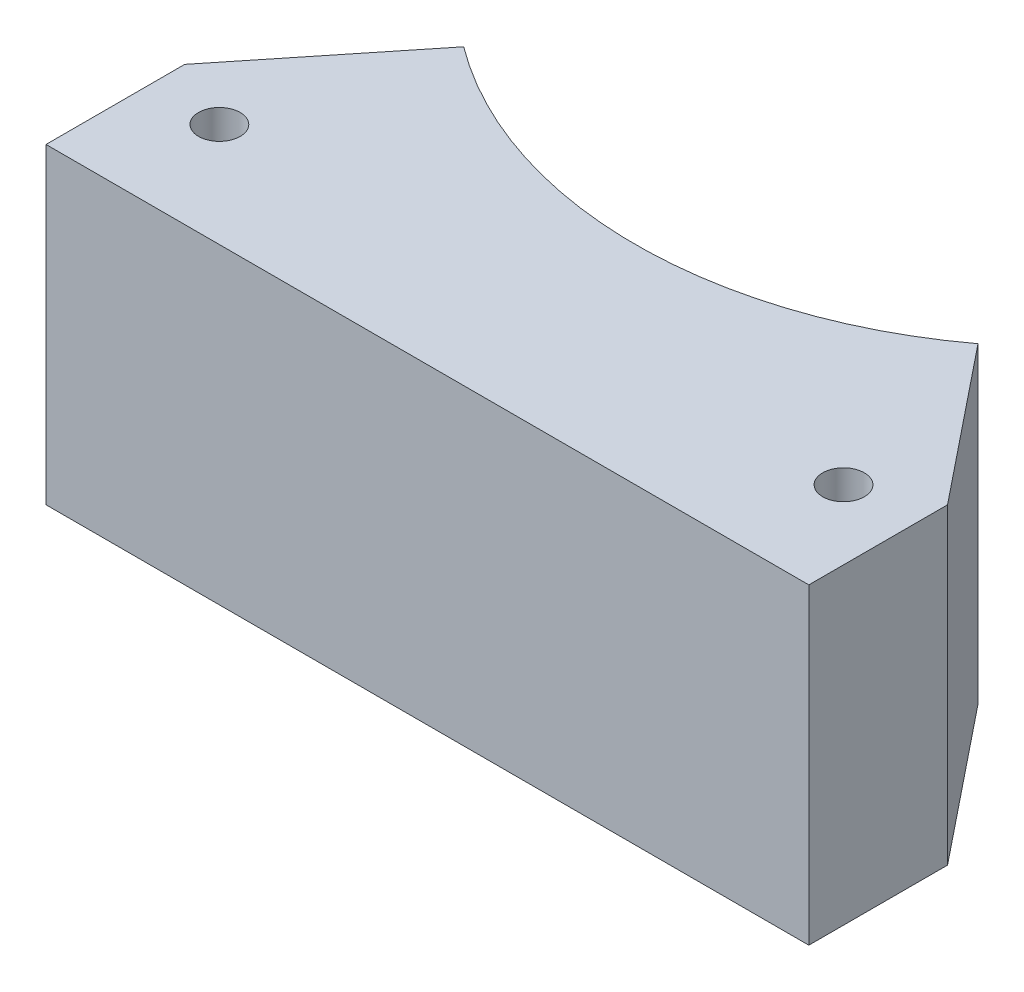
ISO-10303-21;
HEADER;
FILE_DESCRIPTION(('STEP AP214'),'2;1');
FILE_NAME('part.step','',(''),(''),'','','');
FILE_SCHEMA(('AUTOMOTIVE_DESIGN { 1 0 10303 214 1 1 1 1 }'));
ENDSEC;
DATA;
#1=APPLICATION_CONTEXT('core data for automotive mechanical design processes');
#2=APPLICATION_PROTOCOL_DEFINITION('international standard','automotive_design',2000,#1);
#3=PRODUCT_CONTEXT('',#1,'mechanical');
#4=PRODUCT('Part','Part','',(#3));
#5=PRODUCT_RELATED_PRODUCT_CATEGORY('part','',(#4));
#6=PRODUCT_DEFINITION_FORMATION('','',#4);
#7=PRODUCT_DEFINITION_CONTEXT('part definition',#1,'design');
#8=PRODUCT_DEFINITION('design','',#6,#7);
#9=PRODUCT_DEFINITION_SHAPE('','',#8);
#10=(LENGTH_UNIT() NAMED_UNIT(*) SI_UNIT(.MILLI.,.METRE.));
#11=(NAMED_UNIT(*) PLANE_ANGLE_UNIT() SI_UNIT($,.RADIAN.));
#12=(NAMED_UNIT(*) SI_UNIT($,.STERADIAN.) SOLID_ANGLE_UNIT());
#13=UNCERTAINTY_MEASURE_WITH_UNIT(LENGTH_MEASURE(1.E-05),#10,'distance_accuracy_value','');
#14=(GEOMETRIC_REPRESENTATION_CONTEXT(3) GLOBAL_UNCERTAINTY_ASSIGNED_CONTEXT((#13)) GLOBAL_UNIT_ASSIGNED_CONTEXT((#10,
#11,#12)) REPRESENTATION_CONTEXT('',''));
#15=CARTESIAN_POINT('',(0.,0.,0.));
#16=DIRECTION('',(0.,0.,1.));
#17=DIRECTION('',(1.,0.,0.));
#18=AXIS2_PLACEMENT_3D('',#15,#16,#17);
#19=CARTESIAN_POINT('',(-33.1340055886578,45.,2.16335205768863));
#20=DIRECTION('',(1.,0.,0.));
#21=DIRECTION('',(0.,0.,-1.));
#22=AXIS2_PLACEMENT_3D('',#19,#20,#21);
#23=PLANE('',#22);
#24=DIRECTION('',(0.,0.,1.));
#25=VECTOR('',#24,1.);
#26=CARTESIAN_POINT('',(-33.1340055886578,0.,2.16335205768863));
#27=LINE('',#26,#25);
#28=CARTESIAN_POINT('',(-33.1340055886578,0.,2.16335205768863));
#29=VERTEX_POINT('',#28);
#30=CARTESIAN_POINT('',(-33.1340055886578,0.,22.1633520576886));
#31=VERTEX_POINT('',#30);
#32=EDGE_CURVE('E99',#29,#31,#27,.T.);
#33=ORIENTED_EDGE('',*,*,#32,.T.);
#34=DIRECTION('',(0.,-1.,0.));
#35=VECTOR('',#34,1.);
#36=CARTESIAN_POINT('',(-33.1340055886578,45.,22.1633520576886));
#37=LINE('',#36,#35);
#38=CARTESIAN_POINT('',(-33.1340055886578,45.,22.1633520576886));
#39=VERTEX_POINT('',#38);
#40=EDGE_CURVE('E40',#39,#31,#37,.T.);
#41=ORIENTED_EDGE('',*,*,#40,.F.);
#42=DIRECTION('',(0.,0.,1.));
#43=VECTOR('',#42,1.);
#44=CARTESIAN_POINT('',(-33.1340055886578,45.,2.16335205768863));
#45=LINE('',#44,#43);
#46=CARTESIAN_POINT('',(-33.1340055886578,45.,2.16335205768863));
#47=VERTEX_POINT('',#46);
#48=EDGE_CURVE('E97',#47,#39,#45,.T.);
#49=ORIENTED_EDGE('',*,*,#48,.F.);
#50=DIRECTION('',(0.,-1.,0.));
#51=VECTOR('',#50,1.);
#52=CARTESIAN_POINT('',(-33.1340055886578,45.,2.16335205768863));
#53=LINE('',#52,#51);
#54=EDGE_CURVE('E86',#47,#29,#53,.T.);
#55=ORIENTED_EDGE('',*,*,#54,.T.);
#56=EDGE_LOOP('',(#33,#41,#49,#55));
#57=FACE_BOUND('',#56,.T.);
#58=ADVANCED_FACE('F33',(#57),#23,.F.);
#59=CARTESIAN_POINT('',(-33.1340055886578,45.,22.1633520576886));
#60=DIRECTION('',(0.,0.,-1.));
#61=DIRECTION('',(-1.,0.,0.));
#62=AXIS2_PLACEMENT_3D('',#59,#60,#61);
#63=PLANE('',#62);
#64=DIRECTION('',(1.,0.,0.));
#65=VECTOR('',#64,1.);
#66=CARTESIAN_POINT('',(-33.1340055886578,0.,22.1633520576886));
#67=LINE('',#66,#65);
#68=CARTESIAN_POINT('',(76.8659944113422,0.,22.1633520576886));
#69=VERTEX_POINT('',#68);
#70=EDGE_CURVE('E95',#31,#69,#67,.T.);
#71=ORIENTED_EDGE('',*,*,#70,.T.);
#72=DIRECTION('',(0.,-1.,0.));
#73=VECTOR('',#72,1.);
#74=CARTESIAN_POINT('',(76.8659944113422,45.,22.1633520576886));
#75=LINE('',#74,#73);
#76=CARTESIAN_POINT('',(76.8659944113422,45.,22.1633520576886));
#77=VERTEX_POINT('',#76);
#78=EDGE_CURVE('E85',#77,#69,#75,.T.);
#79=ORIENTED_EDGE('',*,*,#78,.F.);
#80=DIRECTION('',(1.,0.,0.));
#81=VECTOR('',#80,1.);
#82=CARTESIAN_POINT('',(-33.1340055886578,45.,22.1633520576886));
#83=LINE('',#82,#81);
#84=EDGE_CURVE('E56',#39,#77,#83,.T.);
#85=ORIENTED_EDGE('',*,*,#84,.F.);
#86=ORIENTED_EDGE('',*,*,#40,.T.);
#87=EDGE_LOOP('',(#71,#79,#85,#86));
#88=FACE_BOUND('',#87,.T.);
#89=ADVANCED_FACE('F110',(#88),#63,.F.);
#90=CARTESIAN_POINT('',(76.8659944113422,45.,22.1633520576886));
#91=DIRECTION('',(-1.,0.,0.));
#92=DIRECTION('',(0.,0.,1.));
#93=AXIS2_PLACEMENT_3D('',#90,#91,#92);
#94=PLANE('',#93);
#95=DIRECTION('',(0.,0.,-1.));
#96=VECTOR('',#95,1.);
#97=CARTESIAN_POINT('',(76.8659944113422,0.,22.1633520576886));
#98=LINE('',#97,#96);
#99=CARTESIAN_POINT('',(76.8659944113422,0.,2.16335205768863));
#100=VERTEX_POINT('',#99);
#101=EDGE_CURVE('E91',#69,#100,#98,.T.);
#102=ORIENTED_EDGE('',*,*,#101,.T.);
#103=DIRECTION('',(0.,-1.,0.));
#104=VECTOR('',#103,1.);
#105=CARTESIAN_POINT('',(76.8659944113422,45.,2.16335205768863));
#106=LINE('',#105,#104);
#107=CARTESIAN_POINT('',(76.8659944113422,45.,2.16335205768863));
#108=VERTEX_POINT('',#107);
#109=EDGE_CURVE('E73',#108,#100,#106,.T.);
#110=ORIENTED_EDGE('',*,*,#109,.F.);
#111=DIRECTION('',(0.,0.,-1.));
#112=VECTOR('',#111,1.);
#113=CARTESIAN_POINT('',(76.8659944113422,45.,22.1633520576886));
#114=LINE('',#113,#112);
#115=EDGE_CURVE('E123',#77,#108,#114,.T.);
#116=ORIENTED_EDGE('',*,*,#115,.F.);
#117=ORIENTED_EDGE('',*,*,#78,.T.);
#118=EDGE_LOOP('',(#102,#110,#116,#117));
#119=FACE_BOUND('',#118,.T.);
#120=ADVANCED_FACE('F94',(#119),#94,.F.);
#121=CARTESIAN_POINT('',(21.8659944113422,45.,-69.8366479423114));
#122=DIRECTION('',(0.,-1.,0.));
#123=DIRECTION('',(0.,0.,-1.));
#124=AXIS2_PLACEMENT_3D('',#121,#122,#123);
#125=CYLINDRICAL_SURFACE('',#124,62.);
#126=CARTESIAN_POINT('',(21.8659944113422,45.,-69.8366479423114));
#127=DIRECTION('',(0.,-1.,0.));
#128=DIRECTION('',(0.,0.,1.));
#129=AXIS2_PLACEMENT_3D('',#126,#127,#128);
#130=CIRCLE('',#129,62.);
#131=CARTESIAN_POINT('',(58.9475164017854,45.,-20.1480101377561));
#132=VERTEX_POINT('',#131);
#133=CARTESIAN_POINT('',(-15.2155275791011,45.,-20.1480101377561));
#134=VERTEX_POINT('',#133);
#135=EDGE_CURVE('E104',#132,#134,#130,.T.);
#136=ORIENTED_EDGE('',*,*,#135,.F.);
#137=DIRECTION('',(0.,-1.,0.));
#138=VECTOR('',#137,1.);
#139=CARTESIAN_POINT('',(58.9475164017854,45.,-20.1480101377561));
#140=LINE('',#139,#138);
#141=CARTESIAN_POINT('',(58.9475164017854,0.,-20.1480101377561));
#142=VERTEX_POINT('',#141);
#143=EDGE_CURVE('E140',#132,#142,#140,.T.);
#144=ORIENTED_EDGE('',*,*,#143,.T.);
#145=CARTESIAN_POINT('',(21.8659944113422,0.,-69.8366479423114));
#146=DIRECTION('',(0.,-1.,0.));
#147=DIRECTION('',(0.,0.,1.));
#148=AXIS2_PLACEMENT_3D('',#145,#146,#147);
#149=CIRCLE('',#148,62.);
#150=CARTESIAN_POINT('',(-15.2155275791011,0.,-20.1480101377561));
#151=VERTEX_POINT('',#150);
#152=EDGE_CURVE('E47',#142,#151,#149,.T.);
#153=ORIENTED_EDGE('',*,*,#152,.T.);
#154=DIRECTION('',(0.,-1.,0.));
#155=VECTOR('',#154,1.);
#156=CARTESIAN_POINT('',(-15.2155275791011,45.,-20.1480101377561));
#157=LINE('',#156,#155);
#158=EDGE_CURVE('E133',#151,#134,#157,.F.);
#159=ORIENTED_EDGE('',*,*,#158,.T.);
#160=EDGE_LOOP('',(#136,#144,#153,#159));
#161=FACE_BOUND('',#160,.T.);
#162=ADVANCED_FACE('F148',(#161),#125,.F.);
#163=CARTESIAN_POINT('',(21.8659944113422,45.,-69.8366479423114));
#164=DIRECTION('',(0.,1.,0.));
#165=DIRECTION('',(0.,0.,1.));
#166=AXIS2_PLACEMENT_3D('',#163,#164,#165);
#167=PLANE('',#166);
#168=DIRECTION('',(-0.626172474133936,0.,-0.77968457252724));
#169=VECTOR('',#168,1.);
#170=CARTESIAN_POINT('',(55.8145044286086,45.,-24.0491095982645));
#171=LINE('',#170,#169);
#172=EDGE_CURVE('E81',#108,#132,#171,.T.);
#173=ORIENTED_EDGE('',*,*,#172,.T.);
#174=ORIENTED_EDGE('',*,*,#135,.T.);
#175=DIRECTION('',(-0.626172474133936,0.,0.77968457252724));
#176=VECTOR('',#175,1.);
#177=CARTESIAN_POINT('',(-12.0825156059243,45.,-24.0491095982645));
#178=LINE('',#177,#176);
#179=EDGE_CURVE('E137',#134,#47,#178,.T.);
#180=ORIENTED_EDGE('',*,*,#179,.T.);
#181=ORIENTED_EDGE('',*,*,#48,.T.);
#182=ORIENTED_EDGE('',*,*,#84,.T.);
#183=ORIENTED_EDGE('',*,*,#115,.T.);
#184=EDGE_LOOP('',(#173,#174,#180,#181,#182,#183));
#185=FACE_BOUND('',#184,.T.);
#186=CARTESIAN_POINT('',(66.8659944113422,45.,7.16335205768863));
#187=DIRECTION('',(0.,1.,0.));
#188=DIRECTION('',(0.,0.,1.));
#189=AXIS2_PLACEMENT_3D('',#186,#187,#188);
#190=CIRCLE('',#189,3.00000000000004);
#191=CARTESIAN_POINT('',(66.8659944113422,45.,10.1633520576887));
#192=VERTEX_POINT('',#191);
#193=EDGE_CURVE('E130',#192,#192,#190,.T.);
#194=ORIENTED_EDGE('',*,*,#193,.F.);
#195=EDGE_LOOP('',(#194));
#196=FACE_BOUND('',#195,.T.);
#197=CARTESIAN_POINT('',(-23.1340055886578,45.,7.16335205768863));
#198=DIRECTION('',(0.,1.,0.));
#199=DIRECTION('',(0.,0.,1.));
#200=AXIS2_PLACEMENT_3D('',#197,#198,#199);
#201=CIRCLE('',#200,3.);
#202=CARTESIAN_POINT('',(-23.1340055886578,45.,10.1633520576886));
#203=VERTEX_POINT('',#202);
#204=EDGE_CURVE('E118',#203,#203,#201,.T.);
#205=ORIENTED_EDGE('',*,*,#204,.F.);
#206=EDGE_LOOP('',(#205));
#207=FACE_BOUND('',#206,.T.);
#208=ADVANCED_FACE('F144',(#185,#196,#207),#167,.T.);
#209=CARTESIAN_POINT('',(21.8659944113422,0.,-69.8366479423114));
#210=DIRECTION('',(0.,1.,0.));
#211=DIRECTION('',(0.,0.,1.));
#212=AXIS2_PLACEMENT_3D('',#209,#210,#211);
#213=PLANE('',#212);
#214=CARTESIAN_POINT('',(66.8659944113422,0.,7.16335205768863));
#215=DIRECTION('',(0.,1.,0.));
#216=DIRECTION('',(0.,0.,1.));
#217=AXIS2_PLACEMENT_3D('',#214,#215,#216);
#218=CIRCLE('',#217,3.00000000000004);
#219=CARTESIAN_POINT('',(66.8659944113422,0.,10.1633520576887));
#220=VERTEX_POINT('',#219);
#221=EDGE_CURVE('E128',#220,#220,#218,.T.);
#222=ORIENTED_EDGE('',*,*,#221,.T.);
#223=EDGE_LOOP('',(#222));
#224=FACE_BOUND('',#223,.T.);
#225=CARTESIAN_POINT('',(-23.1340055886578,0.,7.16335205768863));
#226=DIRECTION('',(0.,1.,0.));
#227=DIRECTION('',(0.,0.,1.));
#228=AXIS2_PLACEMENT_3D('',#225,#226,#227);
#229=CIRCLE('',#228,3.);
#230=CARTESIAN_POINT('',(-23.1340055886578,0.,10.1633520576886));
#231=VERTEX_POINT('',#230);
#232=EDGE_CURVE('E116',#231,#231,#229,.T.);
#233=ORIENTED_EDGE('',*,*,#232,.T.);
#234=EDGE_LOOP('',(#233));
#235=FACE_BOUND('',#234,.T.);
#236=ORIENTED_EDGE('',*,*,#152,.F.);
#237=DIRECTION('',(-0.626172474133936,0.,-0.77968457252724));
#238=VECTOR('',#237,1.);
#239=CARTESIAN_POINT('',(55.8145044286086,0.,-24.0491095982645));
#240=LINE('',#239,#238);
#241=EDGE_CURVE('E78',#100,#142,#240,.T.);
#242=ORIENTED_EDGE('',*,*,#241,.F.);
#243=ORIENTED_EDGE('',*,*,#101,.F.);
#244=ORIENTED_EDGE('',*,*,#70,.F.);
#245=ORIENTED_EDGE('',*,*,#32,.F.);
#246=DIRECTION('',(0.626172474133936,0.,-0.77968457252724));
#247=VECTOR('',#246,1.);
#248=CARTESIAN_POINT('',(23.5826778995958,0.,-68.4579622724636));
#249=LINE('',#248,#247);
#250=EDGE_CURVE('E11',#29,#151,#249,.T.);
#251=ORIENTED_EDGE('',*,*,#250,.T.);
#252=EDGE_LOOP('',(#236,#242,#243,#244,#245,#251));
#253=FACE_BOUND('',#252,.T.);
#254=ADVANCED_FACE('F90',(#224,#235,#253),#213,.F.);
#255=CARTESIAN_POINT('',(-23.1340055886578,0.,7.16335205768863));
#256=DIRECTION('',(0.,1.,0.));
#257=DIRECTION('',(0.,0.,1.));
#258=AXIS2_PLACEMENT_3D('',#255,#256,#257);
#259=CYLINDRICAL_SURFACE('',#258,3.);
#260=ORIENTED_EDGE('',*,*,#232,.F.);
#261=EDGE_LOOP('',(#260));
#262=FACE_BOUND('',#261,.T.);
#263=ORIENTED_EDGE('',*,*,#204,.T.);
#264=EDGE_LOOP('',(#263));
#265=FACE_BOUND('',#264,.T.);
#266=ADVANCED_FACE('F165',(#262,#265),#259,.F.);
#267=CARTESIAN_POINT('',(66.8659944113422,0.,7.16335205768863));
#268=DIRECTION('',(0.,1.,0.));
#269=DIRECTION('',(0.,0.,1.));
#270=AXIS2_PLACEMENT_3D('',#267,#268,#269);
#271=CYLINDRICAL_SURFACE('',#270,3.00000000000004);
#272=ORIENTED_EDGE('',*,*,#221,.F.);
#273=EDGE_LOOP('',(#272));
#274=FACE_BOUND('',#273,.T.);
#275=ORIENTED_EDGE('',*,*,#193,.T.);
#276=EDGE_LOOP('',(#275));
#277=FACE_BOUND('',#276,.T.);
#278=ADVANCED_FACE('F158',(#274,#277),#271,.F.);
#279=CARTESIAN_POINT('',(-12.0825156059243,45.,-24.0491095982645));
#280=DIRECTION('',(0.77968457252724,0.,0.626172474133936));
#281=DIRECTION('',(0.626172474133936,0.,-0.77968457252724));
#282=AXIS2_PLACEMENT_3D('',#279,#280,#281);
#283=PLANE('',#282);
#284=ORIENTED_EDGE('',*,*,#250,.F.);
#285=ORIENTED_EDGE('',*,*,#54,.F.);
#286=ORIENTED_EDGE('',*,*,#179,.F.);
#287=ORIENTED_EDGE('',*,*,#158,.F.);
#288=EDGE_LOOP('',(#284,#285,#286,#287));
#289=FACE_BOUND('',#288,.T.);
#290=ADVANCED_FACE('F152',(#289),#283,.F.);
#291=CARTESIAN_POINT('',(55.8145044286086,45.,-24.0491095982645));
#292=DIRECTION('',(-0.77968457252724,0.,0.626172474133936));
#293=DIRECTION('',(0.626172474133936,0.,0.77968457252724));
#294=AXIS2_PLACEMENT_3D('',#291,#292,#293);
#295=PLANE('',#294);
#296=ORIENTED_EDGE('',*,*,#172,.F.);
#297=ORIENTED_EDGE('',*,*,#109,.T.);
#298=ORIENTED_EDGE('',*,*,#241,.T.);
#299=ORIENTED_EDGE('',*,*,#143,.F.);
#300=EDGE_LOOP('',(#296,#297,#298,#299));
#301=FACE_BOUND('',#300,.T.);
#302=ADVANCED_FACE('F75',(#301),#295,.F.);
#303=CLOSED_SHELL('',(#58,#89,#120,#162,#208,#254,#266,#278,#290,#302));
#304=MANIFOLD_SOLID_BREP('B2',#303);
#305=ADVANCED_BREP_SHAPE_REPRESENTATION('',(#18,#304),#14);
#306=SHAPE_DEFINITION_REPRESENTATION(#9,#305);
ENDSEC;
END-ISO-10303-21;
